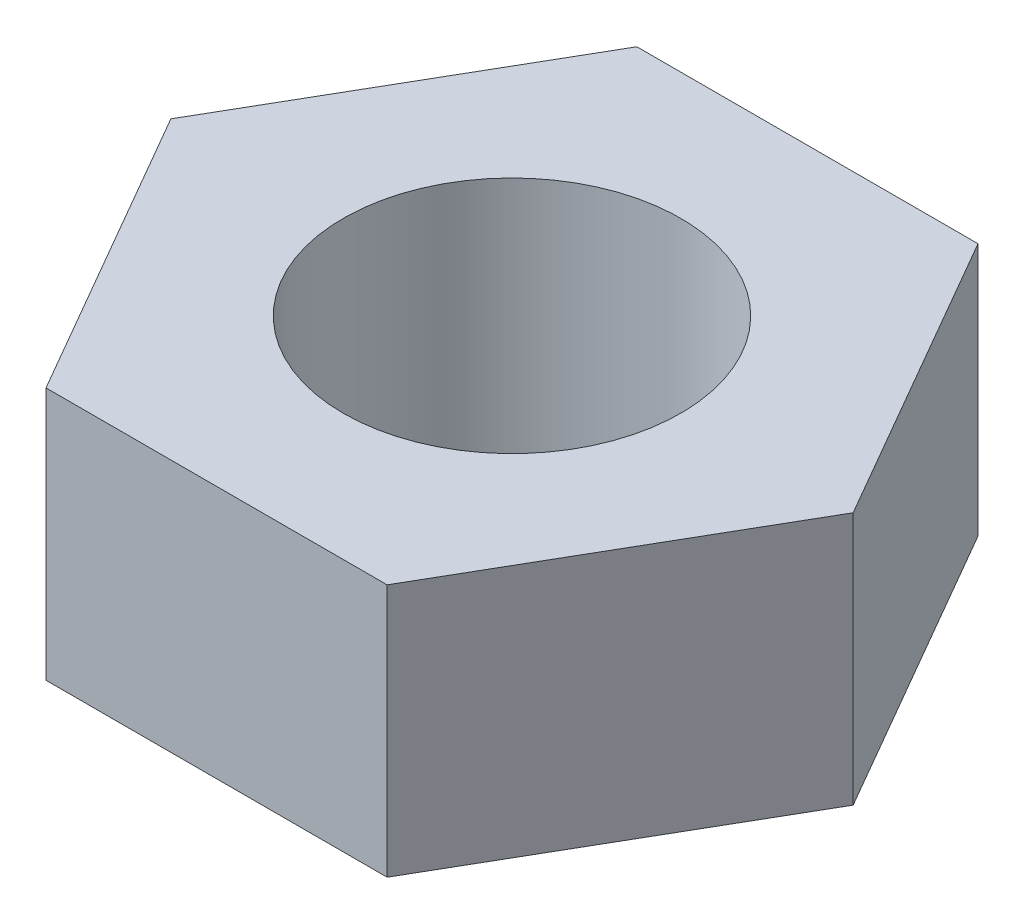
ISO-10303-21;
HEADER;
FILE_DESCRIPTION(('STEP AP214'),'2;1');
FILE_NAME('part.step','',(''),(''),'','','');
FILE_SCHEMA(('AUTOMOTIVE_DESIGN { 1 0 10303 214 1 1 1 1 }'));
ENDSEC;
DATA;
#1=APPLICATION_CONTEXT('core data for automotive mechanical design processes');
#2=APPLICATION_PROTOCOL_DEFINITION('international standard','automotive_design',2000,#1);
#3=PRODUCT_CONTEXT('',#1,'mechanical');
#4=PRODUCT('Part','Part','',(#3));
#5=PRODUCT_RELATED_PRODUCT_CATEGORY('part','',(#4));
#6=PRODUCT_DEFINITION_FORMATION('','',#4);
#7=PRODUCT_DEFINITION_CONTEXT('part definition',#1,'design');
#8=PRODUCT_DEFINITION('design','',#6,#7);
#9=PRODUCT_DEFINITION_SHAPE('','',#8);
#10=(LENGTH_UNIT() NAMED_UNIT(*) SI_UNIT(.MILLI.,.METRE.));
#11=(NAMED_UNIT(*) PLANE_ANGLE_UNIT() SI_UNIT($,.RADIAN.));
#12=(NAMED_UNIT(*) SI_UNIT($,.STERADIAN.) SOLID_ANGLE_UNIT());
#13=UNCERTAINTY_MEASURE_WITH_UNIT(LENGTH_MEASURE(1.E-05),#10,'distance_accuracy_value','');
#14=(GEOMETRIC_REPRESENTATION_CONTEXT(3) GLOBAL_UNCERTAINTY_ASSIGNED_CONTEXT((#13)) GLOBAL_UNIT_ASSIGNED_CONTEXT((#10,
#11,#12)) REPRESENTATION_CONTEXT('',''));
#15=CARTESIAN_POINT('',(0.,0.,0.));
#16=DIRECTION('',(0.,0.,1.));
#17=DIRECTION('',(1.,0.,0.));
#18=AXIS2_PLACEMENT_3D('',#15,#16,#17);
#19=CARTESIAN_POINT('',(0.,3.,0.));
#20=DIRECTION('',(0.,1.,0.));
#21=DIRECTION('',(0.,0.,1.));
#22=AXIS2_PLACEMENT_3D('',#19,#20,#21);
#23=PLANE('',#22);
#24=DIRECTION('',(0.5,0.,-0.866025403784439));
#25=VECTOR('',#24,1.);
#26=CARTESIAN_POINT('',(2.02072594216368,3.,3.50000000000001));
#27=LINE('',#26,#25);
#28=CARTESIAN_POINT('',(2.02072594216368,3.,3.50000000000001));
#29=VERTEX_POINT('',#28);
#30=CARTESIAN_POINT('',(4.04145188432738,3.,0.));
#31=VERTEX_POINT('',#30);
#32=EDGE_CURVE('E131',#29,#31,#27,.T.);
#33=ORIENTED_EDGE('',*,*,#32,.T.);
#34=DIRECTION('',(-0.499999999999999,0.,-0.866025403784439));
#35=VECTOR('',#34,1.);
#36=CARTESIAN_POINT('',(4.04145188432738,3.,0.));
#37=LINE('',#36,#35);
#38=CARTESIAN_POINT('',(2.02072594216368,3.,-3.50000000000003));
#39=VERTEX_POINT('',#38);
#40=EDGE_CURVE('E89',#31,#39,#37,.T.);
#41=ORIENTED_EDGE('',*,*,#40,.T.);
#42=DIRECTION('',(-1.,0.,0.));
#43=VECTOR('',#42,1.);
#44=CARTESIAN_POINT('',(2.02072594216368,3.,-3.50000000000003));
#45=LINE('',#44,#43);
#46=CARTESIAN_POINT('',(-2.0207259421637,3.,-3.50000000000003));
#47=VERTEX_POINT('',#46);
#48=EDGE_CURVE('E102',#39,#47,#45,.T.);
#49=ORIENTED_EDGE('',*,*,#48,.T.);
#50=DIRECTION('',(-0.5,0.,0.866025403784439));
#51=VECTOR('',#50,1.);
#52=CARTESIAN_POINT('',(-2.0207259421637,3.,-3.50000000000003));
#53=LINE('',#52,#51);
#54=CARTESIAN_POINT('',(-4.0414518843274,3.,0.));
#55=VERTEX_POINT('',#54);
#56=EDGE_CURVE('E96',#47,#55,#53,.T.);
#57=ORIENTED_EDGE('',*,*,#56,.T.);
#58=DIRECTION('',(0.500000000000001,0.,0.866025403784438));
#59=VECTOR('',#58,1.);
#60=CARTESIAN_POINT('',(-4.0414518843274,3.,0.));
#61=LINE('',#60,#59);
#62=CARTESIAN_POINT('',(-2.0207259421637,3.,3.50000000000002));
#63=VERTEX_POINT('',#62);
#64=EDGE_CURVE('E100',#55,#63,#61,.T.);
#65=ORIENTED_EDGE('',*,*,#64,.T.);
#66=DIRECTION('',(1.,0.,0.));
#67=VECTOR('',#66,1.);
#68=CARTESIAN_POINT('',(-2.0207259421637,3.,3.50000000000002));
#69=LINE('',#68,#67);
#70=EDGE_CURVE('E52',#63,#29,#69,.T.);
#71=ORIENTED_EDGE('',*,*,#70,.T.);
#72=EDGE_LOOP('',(#33,#41,#49,#57,#65,#71));
#73=FACE_BOUND('',#72,.T.);
#74=CARTESIAN_POINT('',(0.,3.,0.));
#75=DIRECTION('',(0.,1.,0.));
#76=DIRECTION('',(0.,0.,1.));
#77=AXIS2_PLACEMENT_3D('',#74,#75,#76);
#78=CIRCLE('',#77,2.);
#79=CARTESIAN_POINT('',(0.,3.,2.));
#80=VERTEX_POINT('',#79);
#81=EDGE_CURVE('E124',#80,#80,#78,.T.);
#82=ORIENTED_EDGE('',*,*,#81,.F.);
#83=EDGE_LOOP('',(#82));
#84=FACE_BOUND('',#83,.T.);
#85=ADVANCED_FACE('F35',(#73,#84),#23,.T.);
#86=CARTESIAN_POINT('',(0.,0.,0.));
#87=DIRECTION('',(0.,1.,0.));
#88=DIRECTION('',(0.,0.,1.));
#89=AXIS2_PLACEMENT_3D('',#86,#87,#88);
#90=PLANE('',#89);
#91=DIRECTION('',(0.5,0.,-0.866025403784439));
#92=VECTOR('',#91,1.);
#93=CARTESIAN_POINT('',(2.02072594216368,0.,3.50000000000001));
#94=LINE('',#93,#92);
#95=CARTESIAN_POINT('',(2.02072594216368,0.,3.50000000000001));
#96=VERTEX_POINT('',#95);
#97=CARTESIAN_POINT('',(4.04145188432738,0.,0.));
#98=VERTEX_POINT('',#97);
#99=EDGE_CURVE('E120',#96,#98,#94,.T.);
#100=ORIENTED_EDGE('',*,*,#99,.F.);
#101=DIRECTION('',(1.,0.,0.));
#102=VECTOR('',#101,1.);
#103=CARTESIAN_POINT('',(-2.0207259421637,0.,3.50000000000002));
#104=LINE('',#103,#102);
#105=CARTESIAN_POINT('',(-2.0207259421637,0.,3.50000000000002));
#106=VERTEX_POINT('',#105);
#107=EDGE_CURVE('E81',#106,#96,#104,.T.);
#108=ORIENTED_EDGE('',*,*,#107,.F.);
#109=DIRECTION('',(0.500000000000001,0.,0.866025403784438));
#110=VECTOR('',#109,1.);
#111=CARTESIAN_POINT('',(-4.0414518843274,0.,0.));
#112=LINE('',#111,#110);
#113=CARTESIAN_POINT('',(-4.0414518843274,0.,0.));
#114=VERTEX_POINT('',#113);
#115=EDGE_CURVE('E75',#114,#106,#112,.T.);
#116=ORIENTED_EDGE('',*,*,#115,.F.);
#117=DIRECTION('',(-0.5,0.,0.866025403784439));
#118=VECTOR('',#117,1.);
#119=CARTESIAN_POINT('',(-2.0207259421637,0.,-3.50000000000003));
#120=LINE('',#119,#118);
#121=CARTESIAN_POINT('',(-2.0207259421637,0.,-3.50000000000003));
#122=VERTEX_POINT('',#121);
#123=EDGE_CURVE('E110',#122,#114,#120,.T.);
#124=ORIENTED_EDGE('',*,*,#123,.F.);
#125=DIRECTION('',(-1.,0.,0.));
#126=VECTOR('',#125,1.);
#127=CARTESIAN_POINT('',(2.02072594216368,0.,-3.50000000000003));
#128=LINE('',#127,#126);
#129=CARTESIAN_POINT('',(2.02072594216368,0.,-3.50000000000003));
#130=VERTEX_POINT('',#129);
#131=EDGE_CURVE('E126',#130,#122,#128,.T.);
#132=ORIENTED_EDGE('',*,*,#131,.F.);
#133=DIRECTION('',(-0.499999999999999,0.,-0.866025403784439));
#134=VECTOR('',#133,1.);
#135=CARTESIAN_POINT('',(4.04145188432738,0.,0.));
#136=LINE('',#135,#134);
#137=EDGE_CURVE('E123',#98,#130,#136,.T.);
#138=ORIENTED_EDGE('',*,*,#137,.F.);
#139=EDGE_LOOP('',(#100,#108,#116,#124,#132,#138));
#140=FACE_BOUND('',#139,.T.);
#141=CARTESIAN_POINT('',(0.,0.,0.));
#142=DIRECTION('',(0.,1.,0.));
#143=DIRECTION('',(0.,0.,1.));
#144=AXIS2_PLACEMENT_3D('',#141,#142,#143);
#145=CIRCLE('',#144,2.);
#146=CARTESIAN_POINT('',(0.,0.,2.));
#147=VERTEX_POINT('',#146);
#148=EDGE_CURVE('E224',#147,#147,#145,.T.);
#149=ORIENTED_EDGE('',*,*,#148,.T.);
#150=EDGE_LOOP('',(#149));
#151=FACE_BOUND('',#150,.T.);
#152=ADVANCED_FACE('F140',(#140,#151),#90,.F.);
#153=CARTESIAN_POINT('',(2.02072594216368,3.,3.50000000000001));
#154=DIRECTION('',(-0.866025403784439,0.,-0.5));
#155=DIRECTION('',(-0.5,0.,0.866025403784439));
#156=AXIS2_PLACEMENT_3D('',#153,#154,#155);
#157=PLANE('',#156);
#158=ORIENTED_EDGE('',*,*,#99,.T.);
#159=DIRECTION('',(0.,-1.,0.));
#160=VECTOR('',#159,1.);
#161=CARTESIAN_POINT('',(4.04145188432738,3.,0.));
#162=LINE('',#161,#160);
#163=EDGE_CURVE('E11',#31,#98,#162,.T.);
#164=ORIENTED_EDGE('',*,*,#163,.F.);
#165=ORIENTED_EDGE('',*,*,#32,.F.);
#166=DIRECTION('',(0.,-1.,0.));
#167=VECTOR('',#166,1.);
#168=CARTESIAN_POINT('',(2.02072594216368,3.,3.50000000000001));
#169=LINE('',#168,#167);
#170=EDGE_CURVE('E116',#29,#96,#169,.T.);
#171=ORIENTED_EDGE('',*,*,#170,.T.);
#172=EDGE_LOOP('',(#158,#164,#165,#171));
#173=FACE_BOUND('',#172,.T.);
#174=ADVANCED_FACE('F37',(#173),#157,.F.);
#175=CARTESIAN_POINT('',(4.04145188432738,3.,0.));
#176=DIRECTION('',(-0.866025403784439,0.,0.499999999999999));
#177=DIRECTION('',(0.499999999999999,0.,0.866025403784439));
#178=AXIS2_PLACEMENT_3D('',#175,#176,#177);
#179=PLANE('',#178);
#180=ORIENTED_EDGE('',*,*,#137,.T.);
#181=DIRECTION('',(0.,-1.,0.));
#182=VECTOR('',#181,1.);
#183=CARTESIAN_POINT('',(2.02072594216368,3.,-3.50000000000003));
#184=LINE('',#183,#182);
#185=EDGE_CURVE('E44',#39,#130,#184,.T.);
#186=ORIENTED_EDGE('',*,*,#185,.F.);
#187=ORIENTED_EDGE('',*,*,#40,.F.);
#188=ORIENTED_EDGE('',*,*,#163,.T.);
#189=EDGE_LOOP('',(#180,#186,#187,#188));
#190=FACE_BOUND('',#189,.T.);
#191=ADVANCED_FACE('F165',(#190),#179,.F.);
#192=CARTESIAN_POINT('',(2.02072594216368,3.,-3.50000000000003));
#193=DIRECTION('',(0.,0.,1.));
#194=DIRECTION('',(1.,0.,0.));
#195=AXIS2_PLACEMENT_3D('',#192,#193,#194);
#196=PLANE('',#195);
#197=ORIENTED_EDGE('',*,*,#131,.T.);
#198=DIRECTION('',(0.,-1.,0.));
#199=VECTOR('',#198,1.);
#200=CARTESIAN_POINT('',(-2.0207259421637,3.,-3.50000000000003));
#201=LINE('',#200,#199);
#202=EDGE_CURVE('E111',#47,#122,#201,.T.);
#203=ORIENTED_EDGE('',*,*,#202,.F.);
#204=ORIENTED_EDGE('',*,*,#48,.F.);
#205=ORIENTED_EDGE('',*,*,#185,.T.);
#206=EDGE_LOOP('',(#197,#203,#204,#205));
#207=FACE_BOUND('',#206,.T.);
#208=ADVANCED_FACE('F137',(#207),#196,.F.);
#209=CARTESIAN_POINT('',(-2.0207259421637,3.,-3.50000000000003));
#210=DIRECTION('',(0.866025403784439,0.,0.5));
#211=DIRECTION('',(0.5,0.,-0.866025403784439));
#212=AXIS2_PLACEMENT_3D('',#209,#210,#211);
#213=PLANE('',#212);
#214=ORIENTED_EDGE('',*,*,#123,.T.);
#215=DIRECTION('',(0.,-1.,0.));
#216=VECTOR('',#215,1.);
#217=CARTESIAN_POINT('',(-4.0414518843274,3.,0.));
#218=LINE('',#217,#216);
#219=EDGE_CURVE('E107',#55,#114,#218,.T.);
#220=ORIENTED_EDGE('',*,*,#219,.F.);
#221=ORIENTED_EDGE('',*,*,#56,.F.);
#222=ORIENTED_EDGE('',*,*,#202,.T.);
#223=EDGE_LOOP('',(#214,#220,#221,#222));
#224=FACE_BOUND('',#223,.T.);
#225=ADVANCED_FACE('F108',(#224),#213,.F.);
#226=CARTESIAN_POINT('',(-4.0414518843274,3.,0.));
#227=DIRECTION('',(0.866025403784438,0.,-0.500000000000001));
#228=DIRECTION('',(-0.500000000000001,0.,-0.866025403784438));
#229=AXIS2_PLACEMENT_3D('',#226,#227,#228);
#230=PLANE('',#229);
#231=ORIENTED_EDGE('',*,*,#115,.T.);
#232=DIRECTION('',(0.,-1.,0.));
#233=VECTOR('',#232,1.);
#234=CARTESIAN_POINT('',(-2.0207259421637,3.,3.50000000000002));
#235=LINE('',#234,#233);
#236=EDGE_CURVE('E112',#63,#106,#235,.T.);
#237=ORIENTED_EDGE('',*,*,#236,.F.);
#238=ORIENTED_EDGE('',*,*,#64,.F.);
#239=ORIENTED_EDGE('',*,*,#219,.T.);
#240=EDGE_LOOP('',(#231,#237,#238,#239));
#241=FACE_BOUND('',#240,.T.);
#242=ADVANCED_FACE('F114',(#241),#230,.F.);
#243=CARTESIAN_POINT('',(-2.0207259421637,3.,3.50000000000002));
#244=DIRECTION('',(0.,0.,-1.));
#245=DIRECTION('',(-1.,0.,0.));
#246=AXIS2_PLACEMENT_3D('',#243,#244,#245);
#247=PLANE('',#246);
#248=ORIENTED_EDGE('',*,*,#107,.T.);
#249=ORIENTED_EDGE('',*,*,#170,.F.);
#250=ORIENTED_EDGE('',*,*,#70,.F.);
#251=ORIENTED_EDGE('',*,*,#236,.T.);
#252=EDGE_LOOP('',(#248,#249,#250,#251));
#253=FACE_BOUND('',#252,.T.);
#254=ADVANCED_FACE('F145',(#253),#247,.F.);
#255=CARTESIAN_POINT('',(0.,3.,0.));
#256=DIRECTION('',(0.,-1.,0.));
#257=DIRECTION('',(0.,0.,-1.));
#258=AXIS2_PLACEMENT_3D('',#255,#256,#257);
#259=CYLINDRICAL_SURFACE('',#258,2.);
#260=ORIENTED_EDGE('',*,*,#81,.T.);
#261=EDGE_LOOP('',(#260));
#262=FACE_BOUND('',#261,.T.);
#263=ORIENTED_EDGE('',*,*,#148,.F.);
#264=EDGE_LOOP('',(#263));
#265=FACE_BOUND('',#264,.T.);
#266=ADVANCED_FACE('F147',(#262,#265),#259,.F.);
#267=CLOSED_SHELL('',(#85,#152,#174,#191,#208,#225,#242,#254,#266));
#268=MANIFOLD_SOLID_BREP('B2',#267);
#269=ADVANCED_BREP_SHAPE_REPRESENTATION('',(#18,#268),#14);
#270=SHAPE_DEFINITION_REPRESENTATION(#9,#269);
ENDSEC;
END-ISO-10303-21;
